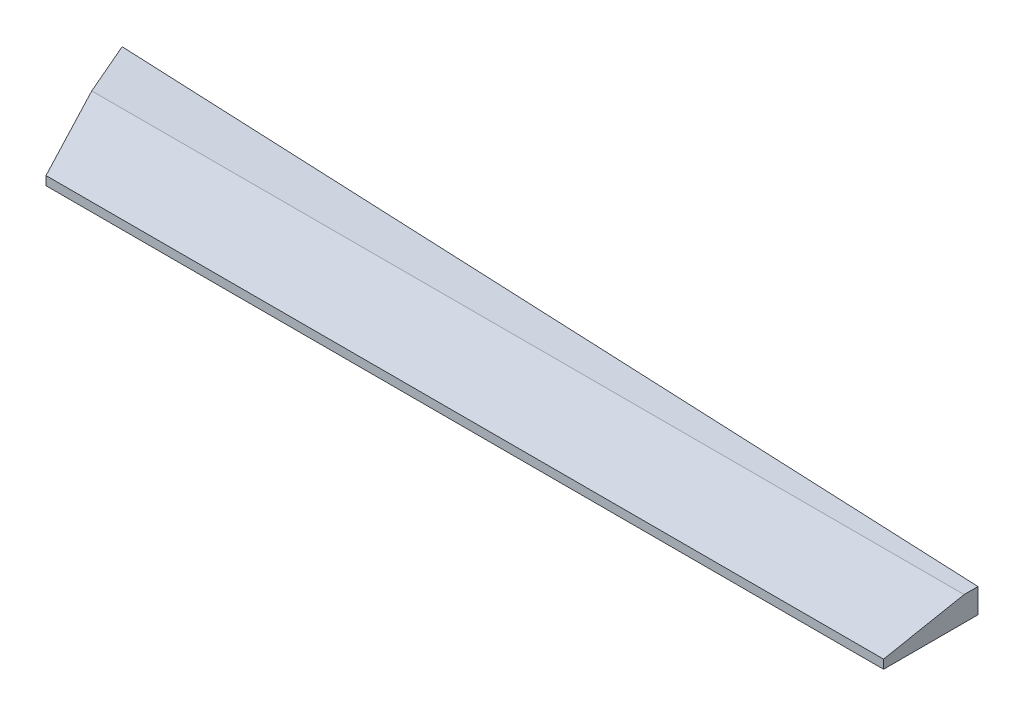
ISO-10303-21;
HEADER;
FILE_DESCRIPTION(('STEP AP214'),'2;1');
FILE_NAME('part.step','',(''),(''),'','','');
FILE_SCHEMA(('AUTOMOTIVE_DESIGN { 1 0 10303 214 1 1 1 1 }'));
ENDSEC;
DATA;
#1=APPLICATION_CONTEXT('core data for automotive mechanical design processes');
#2=APPLICATION_PROTOCOL_DEFINITION('international standard','automotive_design',2000,#1);
#3=PRODUCT_CONTEXT('',#1,'mechanical');
#4=PRODUCT('Part','Part','',(#3));
#5=PRODUCT_RELATED_PRODUCT_CATEGORY('part','',(#4));
#6=PRODUCT_DEFINITION_FORMATION('','',#4);
#7=PRODUCT_DEFINITION_CONTEXT('part definition',#1,'design');
#8=PRODUCT_DEFINITION('design','',#6,#7);
#9=PRODUCT_DEFINITION_SHAPE('','',#8);
#10=(LENGTH_UNIT() NAMED_UNIT(*) SI_UNIT(.MILLI.,.METRE.));
#11=(NAMED_UNIT(*) PLANE_ANGLE_UNIT() SI_UNIT($,.RADIAN.));
#12=(NAMED_UNIT(*) SI_UNIT($,.STERADIAN.) SOLID_ANGLE_UNIT());
#13=UNCERTAINTY_MEASURE_WITH_UNIT(LENGTH_MEASURE(1.E-05),#10,'distance_accuracy_value','');
#14=(GEOMETRIC_REPRESENTATION_CONTEXT(3) GLOBAL_UNCERTAINTY_ASSIGNED_CONTEXT((#13)) GLOBAL_UNIT_ASSIGNED_CONTEXT((#10,
#11,#12)) REPRESENTATION_CONTEXT('',''));
#15=CARTESIAN_POINT('',(0.,0.,0.));
#16=DIRECTION('',(0.,0.,1.));
#17=DIRECTION('',(1.,0.,0.));
#18=AXIS2_PLACEMENT_3D('',#15,#16,#17);
#19=CARTESIAN_POINT('',(98.0332634009864,3.81,1041.10655633203));
#20=DIRECTION('',(-0.0441745230643473,0.,0.999023829301402));
#21=DIRECTION('',(0.999023829301402,0.,0.0441745230643473));
#22=AXIS2_PLACEMENT_3D('',#19,#20,#21);
#23=PLANE('',#22);
#24=DIRECTION('',(-0.999023829301402,0.,-0.0441745230643473));
#25=VECTOR('',#24,1.);
#26=CARTESIAN_POINT('',(98.0332634009864,0.,1041.10655633203));
#27=LINE('',#26,#25);
#28=CARTESIAN_POINT('',(237.469208073523,0.,1047.27209130054));
#29=VERTEX_POINT('',#28);
#30=CARTESIAN_POINT('',(98.0332634009864,0.,1041.10655633203));
#31=VERTEX_POINT('',#30);
#32=EDGE_CURVE('E103',#29,#31,#27,.T.);
#33=ORIENTED_EDGE('',*,*,#32,.T.);
#34=DIRECTION('',(0.,-1.,0.));
#35=VECTOR('',#34,1.);
#36=CARTESIAN_POINT('',(98.0332634009864,3.81,1041.10655633203));
#37=LINE('',#36,#35);
#38=CARTESIAN_POINT('',(98.0332634009864,3.81,1041.10655633203));
#39=VERTEX_POINT('',#38);
#40=EDGE_CURVE('E86',#39,#31,#37,.T.);
#41=ORIENTED_EDGE('',*,*,#40,.F.);
#42=DIRECTION('',(-0.999023829301402,0.,-0.0441745230643473));
#43=VECTOR('',#42,1.);
#44=CARTESIAN_POINT('',(98.0332634009864,3.81,1041.10655633203));
#45=LINE('',#44,#43);
#46=CARTESIAN_POINT('',(237.469208073523,3.81,1047.27209130054));
#47=VERTEX_POINT('',#46);
#48=EDGE_CURVE('E93',#47,#39,#45,.T.);
#49=ORIENTED_EDGE('',*,*,#48,.F.);
#50=DIRECTION('',(0.,-1.,0.));
#51=VECTOR('',#50,1.);
#52=CARTESIAN_POINT('',(237.469208073523,3.81,1047.27209130054));
#53=LINE('',#52,#51);
#54=EDGE_CURVE('E113',#47,#29,#53,.T.);
#55=ORIENTED_EDGE('',*,*,#54,.T.);
#56=EDGE_LOOP('',(#33,#41,#49,#55));
#57=FACE_BOUND('',#56,.T.);
#58=ADVANCED_FACE('F35',(#57),#23,.F.);
#59=CARTESIAN_POINT('',(98.0332634009864,3.81,1041.10655633203));
#60=DIRECTION('',(0.918062353536191,0.,-0.396436016299718));
#61=DIRECTION('',(-0.396436016299718,0.,-0.918062353536191));
#62=AXIS2_PLACEMENT_3D('',#59,#60,#61);
#63=PLANE('',#62);
#64=DIRECTION('',(0.,-1.,0.));
#65=VECTOR('',#64,1.);
#66=CARTESIAN_POINT('',(107.044429893429,3.81,1061.97452084084));
#67=LINE('',#66,#65);
#68=CARTESIAN_POINT('',(107.044429893429,1.37247092341302,1061.97452084084));
#69=VERTEX_POINT('',#68);
#70=CARTESIAN_POINT('',(107.044429893429,0.,1061.97452084084));
#71=VERTEX_POINT('',#70);
#72=EDGE_CURVE('E105',#69,#71,#67,.T.);
#73=ORIENTED_EDGE('',*,*,#72,.F.);
#74=DIRECTION('',(0.390270525700223,-0.175677886265774,0.903784375305781));
#75=VECTOR('',#74,1.);
#76=CARTESIAN_POINT('',(86.1501413382802,10.7779069137682,1013.58774734471));
#77=LINE('',#76,#75);
#78=CARTESIAN_POINT('',(101.629429893429,3.81,1049.43452084084));
#79=VERTEX_POINT('',#78);
#80=EDGE_CURVE('E11',#69,#79,#77,.F.);
#81=ORIENTED_EDGE('',*,*,#80,.T.);
#82=DIRECTION('',(0.396436016299718,0.,0.918062353536191));
#83=VECTOR('',#82,1.);
#84=CARTESIAN_POINT('',(98.0332634009864,3.81,1041.10655633203));
#85=LINE('',#84,#83);
#86=EDGE_CURVE('E81',#39,#79,#85,.T.);
#87=ORIENTED_EDGE('',*,*,#86,.F.);
#88=ORIENTED_EDGE('',*,*,#40,.T.);
#89=DIRECTION('',(0.396436016299718,0.,0.918062353536191));
#90=VECTOR('',#89,1.);
#91=CARTESIAN_POINT('',(98.0332634009864,0.,1041.10655633203));
#92=LINE('',#91,#90);
#93=EDGE_CURVE('E119',#31,#71,#92,.T.);
#94=ORIENTED_EDGE('',*,*,#93,.T.);
#95=EDGE_LOOP('',(#73,#81,#87,#88,#94));
#96=FACE_BOUND('',#95,.T.);
#97=ADVANCED_FACE('F83',(#96),#63,.F.);
#98=CARTESIAN_POINT('',(107.044429893429,3.81,1061.97452084084));
#99=DIRECTION('',(0.,0.,-1.));
#100=DIRECTION('',(-1.,0.,0.));
#101=AXIS2_PLACEMENT_3D('',#98,#99,#100);
#102=PLANE('',#101);
#103=DIRECTION('',(0.,-1.,0.));
#104=VECTOR('',#103,1.);
#105=CARTESIAN_POINT('',(237.469208073523,3.81,1061.97452084084));
#106=LINE('',#105,#104);
#107=CARTESIAN_POINT('',(237.469208073523,1.37247092341302,1061.97452084084));
#108=VERTEX_POINT('',#107);
#109=CARTESIAN_POINT('',(237.469208073523,0.,1061.97452084084));
#110=VERTEX_POINT('',#109);
#111=EDGE_CURVE('E108',#108,#110,#106,.T.);
#112=ORIENTED_EDGE('',*,*,#111,.F.);
#113=DIRECTION('',(-1.,0.,0.));
#114=VECTOR('',#113,1.);
#115=CARTESIAN_POINT('',(107.044429893429,1.37247092341302,1061.97452084084));
#116=LINE('',#115,#114);
#117=EDGE_CURVE('E44',#108,#69,#116,.T.);
#118=ORIENTED_EDGE('',*,*,#117,.T.);
#119=ORIENTED_EDGE('',*,*,#72,.T.);
#120=DIRECTION('',(1.,0.,0.));
#121=VECTOR('',#120,1.);
#122=CARTESIAN_POINT('',(107.044429893429,0.,1061.97452084084));
#123=LINE('',#122,#121);
#124=EDGE_CURVE('E116',#71,#110,#123,.T.);
#125=ORIENTED_EDGE('',*,*,#124,.T.);
#126=EDGE_LOOP('',(#112,#118,#119,#125));
#127=FACE_BOUND('',#126,.T.);
#128=ADVANCED_FACE('F126',(#127),#102,.F.);
#129=CARTESIAN_POINT('',(237.469208073523,3.81,1047.27209130054));
#130=DIRECTION('',(-1.,0.,0.));
#131=DIRECTION('',(0.,0.,1.));
#132=AXIS2_PLACEMENT_3D('',#129,#130,#131);
#133=PLANE('',#132);
#134=DIRECTION('',(0.,0.,-1.));
#135=VECTOR('',#134,1.);
#136=CARTESIAN_POINT('',(237.469208073523,3.81,1047.27209130054));
#137=LINE('',#136,#135);
#138=CARTESIAN_POINT('',(237.469208073523,3.81,1049.43452084084));
#139=VERTEX_POINT('',#138);
#140=EDGE_CURVE('E92',#139,#47,#137,.T.);
#141=ORIENTED_EDGE('',*,*,#140,.F.);
#142=DIRECTION('',(0.,0.190808995376541,-0.981627183447665));
#143=VECTOR('',#142,1.);
#144=CARTESIAN_POINT('',(237.469208073523,3.81,1049.43452084084));
#145=LINE('',#144,#143);
#146=EDGE_CURVE('E58',#139,#108,#145,.F.);
#147=ORIENTED_EDGE('',*,*,#146,.T.);
#148=ORIENTED_EDGE('',*,*,#111,.T.);
#149=DIRECTION('',(0.,0.,-1.));
#150=VECTOR('',#149,1.);
#151=CARTESIAN_POINT('',(237.469208073523,0.,1047.27209130054));
#152=LINE('',#151,#150);
#153=EDGE_CURVE('E100',#110,#29,#152,.T.);
#154=ORIENTED_EDGE('',*,*,#153,.T.);
#155=ORIENTED_EDGE('',*,*,#54,.F.);
#156=EDGE_LOOP('',(#141,#147,#148,#154,#155));
#157=FACE_BOUND('',#156,.T.);
#158=ADVANCED_FACE('F128',(#157),#133,.F.);
#159=CARTESIAN_POINT('',(0.,3.81,0.));
#160=DIRECTION('',(0.,-1.,0.));
#161=DIRECTION('',(0.,0.,-1.));
#162=AXIS2_PLACEMENT_3D('',#159,#160,#161);
#163=PLANE('',#162);
#164=ORIENTED_EDGE('',*,*,#86,.T.);
#165=DIRECTION('',(1.,0.,0.));
#166=VECTOR('',#165,1.);
#167=CARTESIAN_POINT('',(0.,3.81,1049.43452084084));
#168=LINE('',#167,#166);
#169=EDGE_CURVE('E104',#79,#139,#168,.T.);
#170=ORIENTED_EDGE('',*,*,#169,.T.);
#171=ORIENTED_EDGE('',*,*,#140,.T.);
#172=ORIENTED_EDGE('',*,*,#48,.T.);
#173=EDGE_LOOP('',(#164,#170,#171,#172));
#174=FACE_BOUND('',#173,.T.);
#175=ADVANCED_FACE('F96',(#174),#163,.F.);
#176=CARTESIAN_POINT('',(0.,0.,0.));
#177=DIRECTION('',(0.,-1.,0.));
#178=DIRECTION('',(0.,0.,-1.));
#179=AXIS2_PLACEMENT_3D('',#176,#177,#178);
#180=PLANE('',#179);
#181=ORIENTED_EDGE('',*,*,#32,.F.);
#182=ORIENTED_EDGE('',*,*,#153,.F.);
#183=ORIENTED_EDGE('',*,*,#124,.F.);
#184=ORIENTED_EDGE('',*,*,#93,.F.);
#185=EDGE_LOOP('',(#181,#182,#183,#184));
#186=FACE_BOUND('',#185,.T.);
#187=ADVANCED_FACE('F125',(#186),#180,.T.);
#188=CARTESIAN_POINT('',(0.,3.81,1049.43452084084));
#189=DIRECTION('',(0.,-0.981627183447665,-0.190808995376541));
#190=DIRECTION('',(1.,0.,0.));
#191=AXIS2_PLACEMENT_3D('',#188,#189,#190);
#192=PLANE('',#191);
#193=ORIENTED_EDGE('',*,*,#80,.F.);
#194=ORIENTED_EDGE('',*,*,#117,.F.);
#195=ORIENTED_EDGE('',*,*,#146,.F.);
#196=ORIENTED_EDGE('',*,*,#169,.F.);
#197=EDGE_LOOP('',(#193,#194,#195,#196));
#198=FACE_BOUND('',#197,.T.);
#199=ADVANCED_FACE('F38',(#198),#192,.F.);
#200=CLOSED_SHELL('',(#58,#97,#128,#158,#175,#187,#199));
#201=MANIFOLD_SOLID_BREP('B2',#200);
#202=ADVANCED_BREP_SHAPE_REPRESENTATION('',(#18,#201),#14);
#203=SHAPE_DEFINITION_REPRESENTATION(#9,#202);
ENDSEC;
END-ISO-10303-21;
